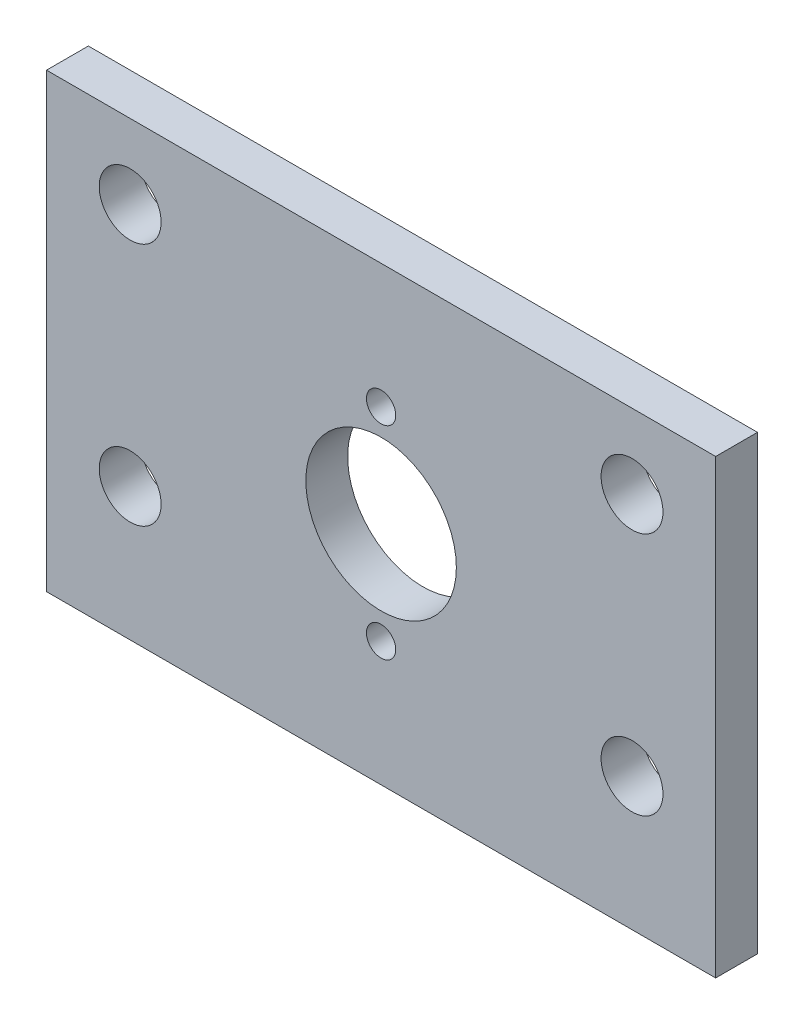
ISO-10303-21;
HEADER;
FILE_DESCRIPTION(('STEP AP214'),'2;1');
FILE_NAME('part.step','',(''),(''),'','','');
FILE_SCHEMA(('AUTOMOTIVE_DESIGN { 1 0 10303 214 1 1 1 1 }'));
ENDSEC;
DATA;
#1=APPLICATION_CONTEXT('core data for automotive mechanical design processes');
#2=APPLICATION_PROTOCOL_DEFINITION('international standard','automotive_design',2000,#1);
#3=PRODUCT_CONTEXT('',#1,'mechanical');
#4=PRODUCT('Part','Part','',(#3));
#5=PRODUCT_RELATED_PRODUCT_CATEGORY('part','',(#4));
#6=PRODUCT_DEFINITION_FORMATION('','',#4);
#7=PRODUCT_DEFINITION_CONTEXT('part definition',#1,'design');
#8=PRODUCT_DEFINITION('design','',#6,#7);
#9=PRODUCT_DEFINITION_SHAPE('','',#8);
#10=(LENGTH_UNIT() NAMED_UNIT(*) SI_UNIT(.MILLI.,.METRE.));
#11=(NAMED_UNIT(*) PLANE_ANGLE_UNIT() SI_UNIT($,.RADIAN.));
#12=(NAMED_UNIT(*) SI_UNIT($,.STERADIAN.) SOLID_ANGLE_UNIT());
#13=UNCERTAINTY_MEASURE_WITH_UNIT(LENGTH_MEASURE(1.E-05),#10,'distance_accuracy_value','');
#14=(GEOMETRIC_REPRESENTATION_CONTEXT(3) GLOBAL_UNCERTAINTY_ASSIGNED_CONTEXT((#13)) GLOBAL_UNIT_ASSIGNED_CONTEXT((#10,
#11,#12)) REPRESENTATION_CONTEXT('',''));
#15=CARTESIAN_POINT('',(0.,0.,0.));
#16=DIRECTION('',(0.,0.,1.));
#17=DIRECTION('',(1.,0.,0.));
#18=AXIS2_PLACEMENT_3D('',#15,#16,#17);
#19=CARTESIAN_POINT('',(0.,0.,3.175));
#20=DIRECTION('',(0.,0.,-1.));
#21=DIRECTION('',(-1.,0.,0.));
#22=AXIS2_PLACEMENT_3D('',#19,#20,#21);
#23=PLANE('',#22);
#24=DIRECTION('',(0.,1.,0.));
#25=VECTOR('',#24,1.);
#26=CARTESIAN_POINT('',(25.4,-17.145,3.175));
#27=LINE('',#26,#25);
#28=CARTESIAN_POINT('',(25.4,-17.145,3.175));
#29=VERTEX_POINT('',#28);
#30=CARTESIAN_POINT('',(25.4,17.145,3.175));
#31=VERTEX_POINT('',#30);
#32=EDGE_CURVE('E93',#29,#31,#27,.T.);
#33=ORIENTED_EDGE('',*,*,#32,.T.);
#34=DIRECTION('',(-1.,0.,0.));
#35=VECTOR('',#34,1.);
#36=CARTESIAN_POINT('',(-25.4,17.145,3.175));
#37=LINE('',#36,#35);
#38=CARTESIAN_POINT('',(-25.4,17.145,3.175));
#39=VERTEX_POINT('',#38);
#40=EDGE_CURVE('E88',#31,#39,#37,.T.);
#41=ORIENTED_EDGE('',*,*,#40,.T.);
#42=DIRECTION('',(0.,-1.,0.));
#43=VECTOR('',#42,1.);
#44=CARTESIAN_POINT('',(-25.4,-17.145,3.175));
#45=LINE('',#44,#43);
#46=CARTESIAN_POINT('',(-25.4,-17.145,3.175));
#47=VERTEX_POINT('',#46);
#48=EDGE_CURVE('E91',#39,#47,#45,.T.);
#49=ORIENTED_EDGE('',*,*,#48,.T.);
#50=DIRECTION('',(1.,0.,0.));
#51=VECTOR('',#50,1.);
#52=CARTESIAN_POINT('',(-25.4,-17.145,3.175));
#53=LINE('',#52,#51);
#54=EDGE_CURVE('E58',#47,#29,#53,.T.);
#55=ORIENTED_EDGE('',*,*,#54,.T.);
#56=EDGE_LOOP('',(#33,#41,#49,#55));
#57=FACE_BOUND('',#56,.T.);
#58=CARTESIAN_POINT('',(19.05,-7.04849999999997,3.175));
#59=DIRECTION('',(0.,0.,1.));
#60=DIRECTION('',(1.,0.,0.));
#61=AXIS2_PLACEMENT_3D('',#58,#59,#60);
#62=CIRCLE('',#61,2.3495);
#63=CARTESIAN_POINT('',(21.3995,-7.04849999999997,3.175));
#64=VERTEX_POINT('',#63);
#65=EDGE_CURVE('E108',#64,#64,#62,.T.);
#66=ORIENTED_EDGE('',*,*,#65,.F.);
#67=EDGE_LOOP('',(#66));
#68=FACE_BOUND('',#67,.T.);
#69=CARTESIAN_POINT('',(19.05,11.4935,3.175));
#70=DIRECTION('',(0.,0.,1.));
#71=DIRECTION('',(1.,0.,0.));
#72=AXIS2_PLACEMENT_3D('',#69,#70,#71);
#73=CIRCLE('',#72,2.3495);
#74=CARTESIAN_POINT('',(21.3995,11.4935,3.175));
#75=VERTEX_POINT('',#74);
#76=EDGE_CURVE('E123',#75,#75,#73,.T.);
#77=ORIENTED_EDGE('',*,*,#76,.F.);
#78=EDGE_LOOP('',(#77));
#79=FACE_BOUND('',#78,.T.);
#80=CARTESIAN_POINT('',(-19.05,11.4935,3.175));
#81=DIRECTION('',(0.,0.,1.));
#82=DIRECTION('',(1.,0.,0.));
#83=AXIS2_PLACEMENT_3D('',#80,#81,#82);
#84=CIRCLE('',#83,2.3495);
#85=CARTESIAN_POINT('',(-16.7005,11.4935,3.175));
#86=VERTEX_POINT('',#85);
#87=EDGE_CURVE('E129',#86,#86,#84,.T.);
#88=ORIENTED_EDGE('',*,*,#87,.F.);
#89=EDGE_LOOP('',(#88));
#90=FACE_BOUND('',#89,.T.);
#91=CARTESIAN_POINT('',(-19.05,-7.0485,3.175));
#92=DIRECTION('',(0.,0.,1.));
#93=DIRECTION('',(1.,0.,0.));
#94=AXIS2_PLACEMENT_3D('',#91,#92,#93);
#95=CIRCLE('',#94,2.3495);
#96=CARTESIAN_POINT('',(-16.7005,-7.0485,3.175));
#97=VERTEX_POINT('',#96);
#98=EDGE_CURVE('E135',#97,#97,#95,.T.);
#99=ORIENTED_EDGE('',*,*,#98,.F.);
#100=EDGE_LOOP('',(#99));
#101=FACE_BOUND('',#100,.T.);
#102=CARTESIAN_POINT('',(0.,7.70255,3.175));
#103=DIRECTION('',(0.,0.,1.));
#104=DIRECTION('',(1.,0.,0.));
#105=AXIS2_PLACEMENT_3D('',#102,#103,#104);
#106=CIRCLE('',#105,1.11125);
#107=CARTESIAN_POINT('',(1.11125,7.70255,3.175));
#108=VERTEX_POINT('',#107);
#109=EDGE_CURVE('E141',#108,#108,#106,.T.);
#110=ORIENTED_EDGE('',*,*,#109,.F.);
#111=EDGE_LOOP('',(#110));
#112=FACE_BOUND('',#111,.T.);
#113=CARTESIAN_POINT('',(0.,-7.70255,3.175));
#114=DIRECTION('',(0.,0.,1.));
#115=DIRECTION('',(1.,0.,0.));
#116=AXIS2_PLACEMENT_3D('',#113,#114,#115);
#117=CIRCLE('',#116,1.11125);
#118=CARTESIAN_POINT('',(1.11125,-7.70255,3.175));
#119=VERTEX_POINT('',#118);
#120=EDGE_CURVE('E147',#119,#119,#117,.T.);
#121=ORIENTED_EDGE('',*,*,#120,.F.);
#122=EDGE_LOOP('',(#121));
#123=FACE_BOUND('',#122,.T.);
#124=CARTESIAN_POINT('',(0.,0.,3.175));
#125=DIRECTION('',(0.,0.,1.));
#126=DIRECTION('',(1.,0.,0.));
#127=AXIS2_PLACEMENT_3D('',#124,#125,#126);
#128=CIRCLE('',#127,5.715);
#129=CARTESIAN_POINT('',(5.71500000000003,0.,3.175));
#130=VERTEX_POINT('',#129);
#131=EDGE_CURVE('E153',#130,#130,#128,.T.);
#132=ORIENTED_EDGE('',*,*,#131,.F.);
#133=EDGE_LOOP('',(#132));
#134=FACE_BOUND('',#133,.T.);
#135=ADVANCED_FACE('F41',(#57,#68,#79,#90,#101,#112,#123,#134),#23,.F.);
#136=CARTESIAN_POINT('',(0.,0.,0.));
#137=DIRECTION('',(0.,0.,-1.));
#138=DIRECTION('',(-1.,0.,0.));
#139=AXIS2_PLACEMENT_3D('',#136,#137,#138);
#140=PLANE('',#139);
#141=CARTESIAN_POINT('',(0.,-7.70255,0.));
#142=DIRECTION('',(0.,0.,1.));
#143=DIRECTION('',(1.,0.,0.));
#144=AXIS2_PLACEMENT_3D('',#141,#142,#143);
#145=CIRCLE('',#144,1.11125);
#146=CARTESIAN_POINT('',(1.11125,-7.70255,0.));
#147=VERTEX_POINT('',#146);
#148=EDGE_CURVE('E150',#147,#147,#145,.T.);
#149=ORIENTED_EDGE('',*,*,#148,.T.);
#150=EDGE_LOOP('',(#149));
#151=FACE_BOUND('',#150,.T.);
#152=CARTESIAN_POINT('',(-19.05,-7.0485,0.));
#153=DIRECTION('',(0.,0.,1.));
#154=DIRECTION('',(1.,0.,0.));
#155=AXIS2_PLACEMENT_3D('',#152,#153,#154);
#156=CIRCLE('',#155,2.3495);
#157=CARTESIAN_POINT('',(-16.7005,-7.0485,0.));
#158=VERTEX_POINT('',#157);
#159=EDGE_CURVE('E138',#158,#158,#156,.T.);
#160=ORIENTED_EDGE('',*,*,#159,.T.);
#161=EDGE_LOOP('',(#160));
#162=FACE_BOUND('',#161,.T.);
#163=CARTESIAN_POINT('',(19.05,11.4935,0.));
#164=DIRECTION('',(0.,0.,1.));
#165=DIRECTION('',(1.,0.,0.));
#166=AXIS2_PLACEMENT_3D('',#163,#164,#165);
#167=CIRCLE('',#166,2.3495);
#168=CARTESIAN_POINT('',(21.3995,11.4935,0.));
#169=VERTEX_POINT('',#168);
#170=EDGE_CURVE('E126',#169,#169,#167,.T.);
#171=ORIENTED_EDGE('',*,*,#170,.T.);
#172=EDGE_LOOP('',(#171));
#173=FACE_BOUND('',#172,.T.);
#174=DIRECTION('',(0.,1.,0.));
#175=VECTOR('',#174,1.);
#176=CARTESIAN_POINT('',(25.4,-17.145,0.));
#177=LINE('',#176,#175);
#178=CARTESIAN_POINT('',(25.4,-17.145,0.));
#179=VERTEX_POINT('',#178);
#180=CARTESIAN_POINT('',(25.4,17.145,0.));
#181=VERTEX_POINT('',#180);
#182=EDGE_CURVE('E105',#179,#181,#177,.T.);
#183=ORIENTED_EDGE('',*,*,#182,.F.);
#184=DIRECTION('',(1.,0.,0.));
#185=VECTOR('',#184,1.);
#186=CARTESIAN_POINT('',(-25.4,-17.145,0.));
#187=LINE('',#186,#185);
#188=CARTESIAN_POINT('',(-25.4,-17.145,0.));
#189=VERTEX_POINT('',#188);
#190=EDGE_CURVE('E81',#189,#179,#187,.T.);
#191=ORIENTED_EDGE('',*,*,#190,.F.);
#192=DIRECTION('',(0.,-1.,0.));
#193=VECTOR('',#192,1.);
#194=CARTESIAN_POINT('',(-25.4,-17.145,0.));
#195=LINE('',#194,#193);
#196=CARTESIAN_POINT('',(-25.4,17.145,0.));
#197=VERTEX_POINT('',#196);
#198=EDGE_CURVE('E75',#197,#189,#195,.T.);
#199=ORIENTED_EDGE('',*,*,#198,.F.);
#200=DIRECTION('',(-1.,0.,0.));
#201=VECTOR('',#200,1.);
#202=CARTESIAN_POINT('',(-25.4,17.145,0.));
#203=LINE('',#202,#201);
#204=EDGE_CURVE('E97',#181,#197,#203,.T.);
#205=ORIENTED_EDGE('',*,*,#204,.F.);
#206=EDGE_LOOP('',(#183,#191,#199,#205));
#207=FACE_BOUND('',#206,.T.);
#208=CARTESIAN_POINT('',(19.05,-7.04849999999997,0.));
#209=DIRECTION('',(0.,0.,1.));
#210=DIRECTION('',(1.,0.,0.));
#211=AXIS2_PLACEMENT_3D('',#208,#209,#210);
#212=CIRCLE('',#211,2.3495);
#213=CARTESIAN_POINT('',(21.3995,-7.04849999999997,0.));
#214=VERTEX_POINT('',#213);
#215=EDGE_CURVE('E120',#214,#214,#212,.T.);
#216=ORIENTED_EDGE('',*,*,#215,.T.);
#217=EDGE_LOOP('',(#216));
#218=FACE_BOUND('',#217,.T.);
#219=CARTESIAN_POINT('',(-19.05,11.4935,0.));
#220=DIRECTION('',(0.,0.,1.));
#221=DIRECTION('',(1.,0.,0.));
#222=AXIS2_PLACEMENT_3D('',#219,#220,#221);
#223=CIRCLE('',#222,2.3495);
#224=CARTESIAN_POINT('',(-16.7005,11.4935,0.));
#225=VERTEX_POINT('',#224);
#226=EDGE_CURVE('E132',#225,#225,#223,.T.);
#227=ORIENTED_EDGE('',*,*,#226,.T.);
#228=EDGE_LOOP('',(#227));
#229=FACE_BOUND('',#228,.T.);
#230=CARTESIAN_POINT('',(0.,7.70255,0.));
#231=DIRECTION('',(0.,0.,1.));
#232=DIRECTION('',(1.,0.,0.));
#233=AXIS2_PLACEMENT_3D('',#230,#231,#232);
#234=CIRCLE('',#233,1.11125);
#235=CARTESIAN_POINT('',(1.11125,7.70255,0.));
#236=VERTEX_POINT('',#235);
#237=EDGE_CURVE('E144',#236,#236,#234,.T.);
#238=ORIENTED_EDGE('',*,*,#237,.T.);
#239=EDGE_LOOP('',(#238));
#240=FACE_BOUND('',#239,.T.);
#241=CARTESIAN_POINT('',(0.,0.,0.));
#242=DIRECTION('',(0.,0.,1.));
#243=DIRECTION('',(1.,0.,0.));
#244=AXIS2_PLACEMENT_3D('',#241,#242,#243);
#245=CIRCLE('',#244,5.715);
#246=CARTESIAN_POINT('',(5.71500000000003,0.,0.));
#247=VERTEX_POINT('',#246);
#248=EDGE_CURVE('E156',#247,#247,#245,.T.);
#249=ORIENTED_EDGE('',*,*,#248,.T.);
#250=EDGE_LOOP('',(#249));
#251=FACE_BOUND('',#250,.T.);
#252=ADVANCED_FACE('F116',(#151,#162,#173,#207,#218,#229,#240,#251),#140,.T.);
#253=CARTESIAN_POINT('',(25.4,-17.145,3.175));
#254=DIRECTION('',(-1.,0.,0.));
#255=DIRECTION('',(0.,0.,1.));
#256=AXIS2_PLACEMENT_3D('',#253,#254,#255);
#257=PLANE('',#256);
#258=ORIENTED_EDGE('',*,*,#182,.T.);
#259=DIRECTION('',(0.,0.,-1.));
#260=VECTOR('',#259,1.);
#261=CARTESIAN_POINT('',(25.4,17.145,3.175));
#262=LINE('',#261,#260);
#263=EDGE_CURVE('E11',#31,#181,#262,.T.);
#264=ORIENTED_EDGE('',*,*,#263,.F.);
#265=ORIENTED_EDGE('',*,*,#32,.F.);
#266=DIRECTION('',(0.,0.,-1.));
#267=VECTOR('',#266,1.);
#268=CARTESIAN_POINT('',(25.4,-17.145,3.175));
#269=LINE('',#268,#267);
#270=EDGE_CURVE('E101',#29,#179,#269,.T.);
#271=ORIENTED_EDGE('',*,*,#270,.T.);
#272=EDGE_LOOP('',(#258,#264,#265,#271));
#273=FACE_BOUND('',#272,.T.);
#274=ADVANCED_FACE('F43',(#273),#257,.F.);
#275=CARTESIAN_POINT('',(-25.4,17.145,3.175));
#276=DIRECTION('',(0.,-1.,0.));
#277=DIRECTION('',(0.,0.,-1.));
#278=AXIS2_PLACEMENT_3D('',#275,#276,#277);
#279=PLANE('',#278);
#280=ORIENTED_EDGE('',*,*,#204,.T.);
#281=DIRECTION('',(0.,0.,-1.));
#282=VECTOR('',#281,1.);
#283=CARTESIAN_POINT('',(-25.4,17.145,3.175));
#284=LINE('',#283,#282);
#285=EDGE_CURVE('E50',#39,#197,#284,.T.);
#286=ORIENTED_EDGE('',*,*,#285,.F.);
#287=ORIENTED_EDGE('',*,*,#40,.F.);
#288=ORIENTED_EDGE('',*,*,#263,.T.);
#289=EDGE_LOOP('',(#280,#286,#287,#288));
#290=FACE_BOUND('',#289,.T.);
#291=ADVANCED_FACE('F96',(#290),#279,.F.);
#292=CARTESIAN_POINT('',(-25.4,-17.145,3.175));
#293=DIRECTION('',(1.,0.,0.));
#294=DIRECTION('',(0.,0.,-1.));
#295=AXIS2_PLACEMENT_3D('',#292,#293,#294);
#296=PLANE('',#295);
#297=ORIENTED_EDGE('',*,*,#198,.T.);
#298=DIRECTION('',(0.,0.,-1.));
#299=VECTOR('',#298,1.);
#300=CARTESIAN_POINT('',(-25.4,-17.145,3.175));
#301=LINE('',#300,#299);
#302=EDGE_CURVE('E98',#47,#189,#301,.T.);
#303=ORIENTED_EDGE('',*,*,#302,.F.);
#304=ORIENTED_EDGE('',*,*,#48,.F.);
#305=ORIENTED_EDGE('',*,*,#285,.T.);
#306=EDGE_LOOP('',(#297,#303,#304,#305));
#307=FACE_BOUND('',#306,.T.);
#308=ADVANCED_FACE('F99',(#307),#296,.F.);
#309=CARTESIAN_POINT('',(-25.4,-17.145,3.175));
#310=DIRECTION('',(0.,1.,0.));
#311=DIRECTION('',(0.,0.,1.));
#312=AXIS2_PLACEMENT_3D('',#309,#310,#311);
#313=PLANE('',#312);
#314=ORIENTED_EDGE('',*,*,#190,.T.);
#315=ORIENTED_EDGE('',*,*,#270,.F.);
#316=ORIENTED_EDGE('',*,*,#54,.F.);
#317=ORIENTED_EDGE('',*,*,#302,.T.);
#318=EDGE_LOOP('',(#314,#315,#316,#317));
#319=FACE_BOUND('',#318,.T.);
#320=ADVANCED_FACE('F113',(#319),#313,.F.);
#321=CARTESIAN_POINT('',(19.05,-7.04849999999997,3.175));
#322=DIRECTION('',(0.,0.,-1.));
#323=DIRECTION('',(-1.,0.,0.));
#324=AXIS2_PLACEMENT_3D('',#321,#322,#323);
#325=CYLINDRICAL_SURFACE('',#324,2.3495);
#326=ORIENTED_EDGE('',*,*,#65,.T.);
#327=EDGE_LOOP('',(#326));
#328=FACE_BOUND('',#327,.T.);
#329=ORIENTED_EDGE('',*,*,#215,.F.);
#330=EDGE_LOOP('',(#329));
#331=FACE_BOUND('',#330,.T.);
#332=ADVANCED_FACE('F173',(#328,#331),#325,.F.);
#333=CARTESIAN_POINT('',(19.05,11.4935,3.175));
#334=DIRECTION('',(0.,0.,-1.));
#335=DIRECTION('',(-1.,0.,0.));
#336=AXIS2_PLACEMENT_3D('',#333,#334,#335);
#337=CYLINDRICAL_SURFACE('',#336,2.3495);
#338=ORIENTED_EDGE('',*,*,#76,.T.);
#339=EDGE_LOOP('',(#338));
#340=FACE_BOUND('',#339,.T.);
#341=ORIENTED_EDGE('',*,*,#170,.F.);
#342=EDGE_LOOP('',(#341));
#343=FACE_BOUND('',#342,.T.);
#344=ADVANCED_FACE('F218',(#340,#343),#337,.F.);
#345=CARTESIAN_POINT('',(-19.05,11.4935,3.175));
#346=DIRECTION('',(0.,0.,-1.));
#347=DIRECTION('',(-1.,0.,0.));
#348=AXIS2_PLACEMENT_3D('',#345,#346,#347);
#349=CYLINDRICAL_SURFACE('',#348,2.3495);
#350=ORIENTED_EDGE('',*,*,#87,.T.);
#351=EDGE_LOOP('',(#350));
#352=FACE_BOUND('',#351,.T.);
#353=ORIENTED_EDGE('',*,*,#226,.F.);
#354=EDGE_LOOP('',(#353));
#355=FACE_BOUND('',#354,.T.);
#356=ADVANCED_FACE('F226',(#352,#355),#349,.F.);
#357=CARTESIAN_POINT('',(-19.05,-7.0485,3.175));
#358=DIRECTION('',(0.,0.,-1.));
#359=DIRECTION('',(-1.,0.,0.));
#360=AXIS2_PLACEMENT_3D('',#357,#358,#359);
#361=CYLINDRICAL_SURFACE('',#360,2.3495);
#362=ORIENTED_EDGE('',*,*,#98,.T.);
#363=EDGE_LOOP('',(#362));
#364=FACE_BOUND('',#363,.T.);
#365=ORIENTED_EDGE('',*,*,#159,.F.);
#366=EDGE_LOOP('',(#365));
#367=FACE_BOUND('',#366,.T.);
#368=ADVANCED_FACE('F234',(#364,#367),#361,.F.);
#369=CARTESIAN_POINT('',(0.,7.70255,3.175));
#370=DIRECTION('',(0.,0.,-1.));
#371=DIRECTION('',(-1.,0.,0.));
#372=AXIS2_PLACEMENT_3D('',#369,#370,#371);
#373=CYLINDRICAL_SURFACE('',#372,1.11125);
#374=ORIENTED_EDGE('',*,*,#109,.T.);
#375=EDGE_LOOP('',(#374));
#376=FACE_BOUND('',#375,.T.);
#377=ORIENTED_EDGE('',*,*,#237,.F.);
#378=EDGE_LOOP('',(#377));
#379=FACE_BOUND('',#378,.T.);
#380=ADVANCED_FACE('F243',(#376,#379),#373,.F.);
#381=CARTESIAN_POINT('',(0.,-7.70255,3.175));
#382=DIRECTION('',(0.,0.,-1.));
#383=DIRECTION('',(-1.,0.,0.));
#384=AXIS2_PLACEMENT_3D('',#381,#382,#383);
#385=CYLINDRICAL_SURFACE('',#384,1.11125);
#386=ORIENTED_EDGE('',*,*,#120,.T.);
#387=EDGE_LOOP('',(#386));
#388=FACE_BOUND('',#387,.T.);
#389=ORIENTED_EDGE('',*,*,#148,.F.);
#390=EDGE_LOOP('',(#389));
#391=FACE_BOUND('',#390,.T.);
#392=ADVANCED_FACE('F252',(#388,#391),#385,.F.);
#393=CARTESIAN_POINT('',(0.,0.,3.175));
#394=DIRECTION('',(0.,0.,-1.));
#395=DIRECTION('',(-1.,0.,0.));
#396=AXIS2_PLACEMENT_3D('',#393,#394,#395);
#397=CYLINDRICAL_SURFACE('',#396,5.715);
#398=ORIENTED_EDGE('',*,*,#131,.T.);
#399=EDGE_LOOP('',(#398));
#400=FACE_BOUND('',#399,.T.);
#401=ORIENTED_EDGE('',*,*,#248,.F.);
#402=EDGE_LOOP('',(#401));
#403=FACE_BOUND('',#402,.T.);
#404=ADVANCED_FACE('F162',(#400,#403),#397,.F.);
#405=CLOSED_SHELL('',(#135,#252,#274,#291,#308,#320,#332,#344,#356,#368,#380,#392,#404));
#406=MANIFOLD_SOLID_BREP('B2',#405);
#407=ADVANCED_BREP_SHAPE_REPRESENTATION('',(#18,#406),#14);
#408=SHAPE_DEFINITION_REPRESENTATION(#9,#407);
ENDSEC;
END-ISO-10303-21;
